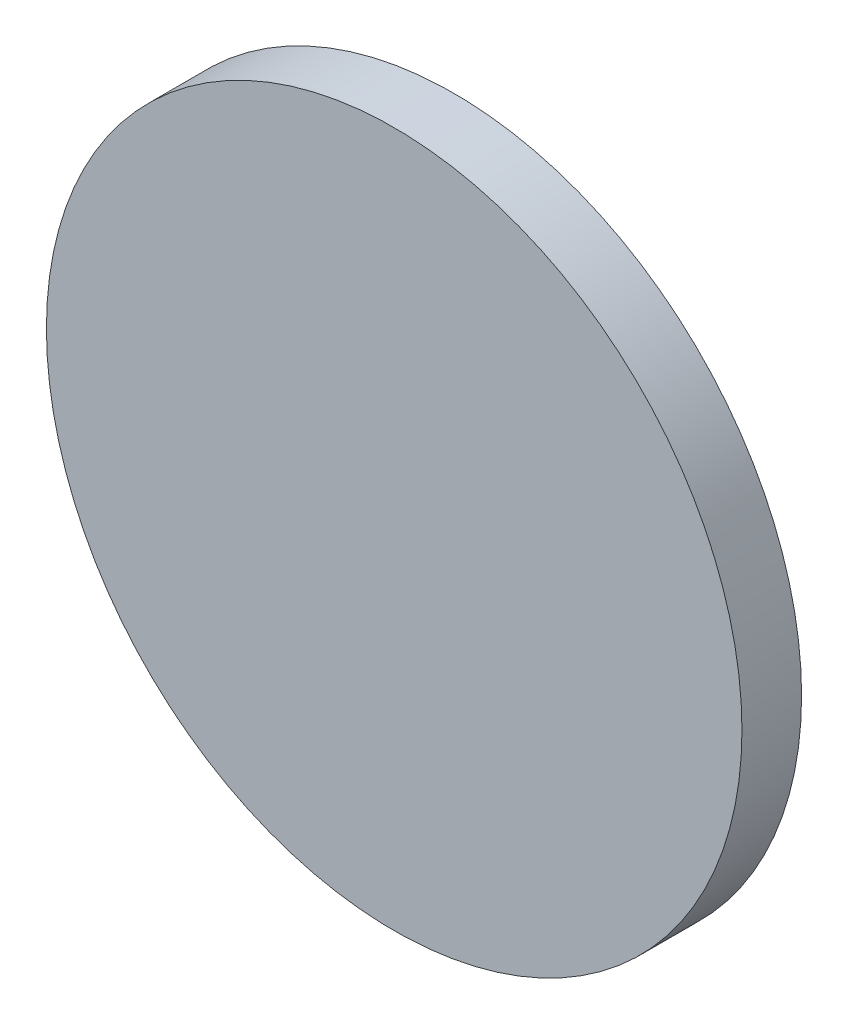
ISO-10303-21;
HEADER;
FILE_DESCRIPTION(('STEP AP214'),'2;1');
FILE_NAME('part.step','',(''),(''),'','','');
FILE_SCHEMA(('AUTOMOTIVE_DESIGN { 1 0 10303 214 1 1 1 1 }'));
ENDSEC;
DATA;
#1=APPLICATION_CONTEXT('core data for automotive mechanical design processes');
#2=APPLICATION_PROTOCOL_DEFINITION('international standard','automotive_design',2000,#1);
#3=PRODUCT_CONTEXT('',#1,'mechanical');
#4=PRODUCT('Part','Part','',(#3));
#5=PRODUCT_RELATED_PRODUCT_CATEGORY('part','',(#4));
#6=PRODUCT_DEFINITION_FORMATION('','',#4);
#7=PRODUCT_DEFINITION_CONTEXT('part definition',#1,'design');
#8=PRODUCT_DEFINITION('design','',#6,#7);
#9=PRODUCT_DEFINITION_SHAPE('','',#8);
#10=(LENGTH_UNIT() NAMED_UNIT(*) SI_UNIT(.MILLI.,.METRE.));
#11=(NAMED_UNIT(*) PLANE_ANGLE_UNIT() SI_UNIT($,.RADIAN.));
#12=(NAMED_UNIT(*) SI_UNIT($,.STERADIAN.) SOLID_ANGLE_UNIT());
#13=UNCERTAINTY_MEASURE_WITH_UNIT(LENGTH_MEASURE(1.E-05),#10,'distance_accuracy_value','');
#14=(GEOMETRIC_REPRESENTATION_CONTEXT(3) GLOBAL_UNCERTAINTY_ASSIGNED_CONTEXT((#13)) GLOBAL_UNIT_ASSIGNED_CONTEXT((#10,
#11,#12)) REPRESENTATION_CONTEXT('',''));
#15=CARTESIAN_POINT('',(0.,0.,0.));
#16=DIRECTION('',(0.,0.,1.));
#17=DIRECTION('',(1.,0.,0.));
#18=AXIS2_PLACEMENT_3D('',#15,#16,#17);
#19=CARTESIAN_POINT('',(6.98208,9.85,0.03429));
#20=DIRECTION('',(0.,0.,1.));
#21=DIRECTION('',(1.,0.,0.));
#22=AXIS2_PLACEMENT_3D('',#19,#20,#21);
#23=PLANE('',#22);
#24=CARTESIAN_POINT('',(6.98208,9.85,0.03429));
#25=DIRECTION('',(0.,0.,1.));
#26=DIRECTION('',(1.,0.,0.));
#27=AXIS2_PLACEMENT_3D('',#24,#25,#26);
#28=CIRCLE('',#27,0.200024667);
#29=CARTESIAN_POINT('',(7.182104667,9.85,0.03429));
#30=VERTEX_POINT('',#29);
#31=EDGE_CURVE('E18',#30,#30,#28,.F.);
#32=ORIENTED_EDGE('',*,*,#31,.F.);
#33=EDGE_LOOP('',(#32));
#34=FACE_BOUND('',#33,.T.);
#35=ADVANCED_FACE('F15',(#34),#23,.T.);
#36=CARTESIAN_POINT('',(6.98208,9.85,0.));
#37=DIRECTION('',(0.,0.,1.));
#38=DIRECTION('',(1.,0.,0.));
#39=AXIS2_PLACEMENT_3D('',#36,#37,#38);
#40=CYLINDRICAL_SURFACE('',#39,0.200024667);
#41=ORIENTED_EDGE('',*,*,#31,.T.);
#42=EDGE_LOOP('',(#41));
#43=FACE_BOUND('',#42,.T.);
#44=CARTESIAN_POINT('',(6.98208,9.85,0.));
#45=DIRECTION('',(0.,0.,1.));
#46=DIRECTION('',(1.,0.,0.));
#47=AXIS2_PLACEMENT_3D('',#44,#45,#46);
#48=CIRCLE('',#47,0.200024667);
#49=CARTESIAN_POINT('',(7.182104667,9.85,0.));
#50=VERTEX_POINT('',#49);
#51=EDGE_CURVE('E10',#50,#50,#48,.F.);
#52=ORIENTED_EDGE('',*,*,#51,.F.);
#53=EDGE_LOOP('',(#52));
#54=FACE_BOUND('',#53,.T.);
#55=ADVANCED_FACE('F27',(#43,#54),#40,.T.);
#56=CARTESIAN_POINT('',(6.98208,9.85,0.));
#57=DIRECTION('',(0.,0.,-1.));
#58=DIRECTION('',(-1.,0.,0.));
#59=AXIS2_PLACEMENT_3D('',#56,#57,#58);
#60=PLANE('',#59);
#61=ORIENTED_EDGE('',*,*,#51,.T.);
#62=EDGE_LOOP('',(#61));
#63=FACE_BOUND('',#62,.T.);
#64=ADVANCED_FACE('F35',(#63),#60,.T.);
#65=CLOSED_SHELL('',(#35,#55,#64));
#66=MANIFOLD_SOLID_BREP('B1',#65);
#67=ADVANCED_BREP_SHAPE_REPRESENTATION('',(#18,#66),#14);
#68=SHAPE_DEFINITION_REPRESENTATION(#9,#67);
ENDSEC;
END-ISO-10303-21;
